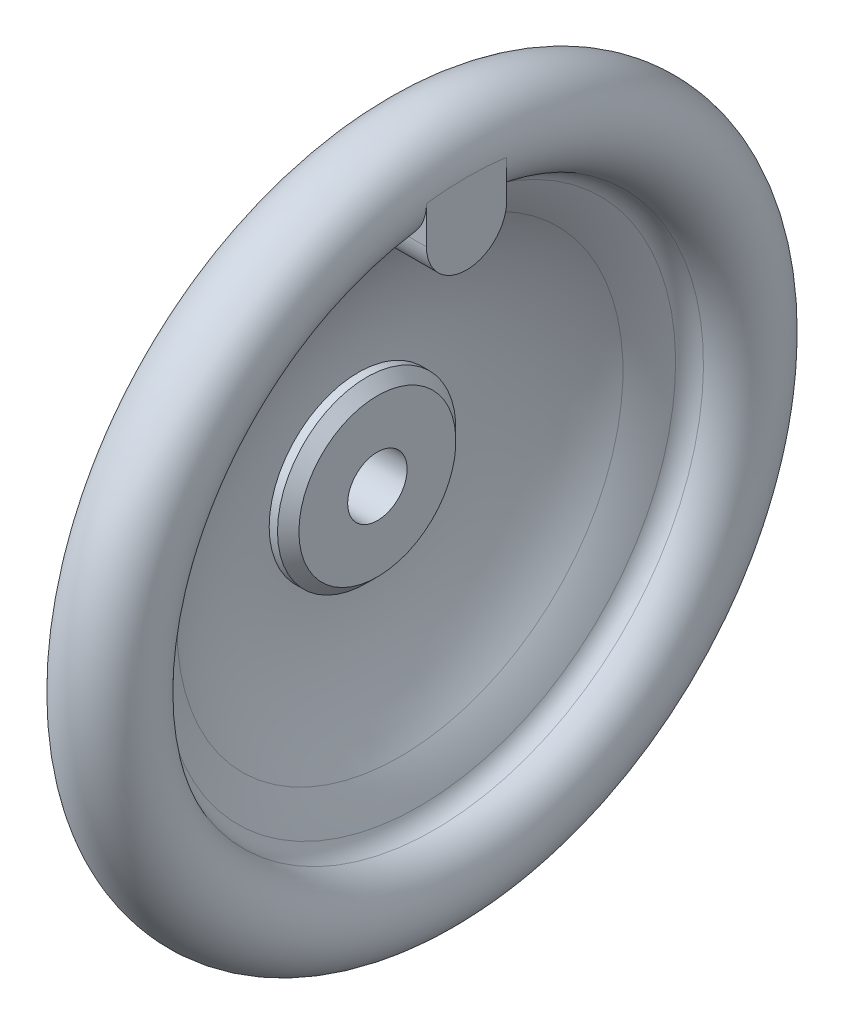
ISO-10303-21;
HEADER;
FILE_DESCRIPTION(('STEP AP214'),'2;1');
FILE_NAME('part.step','',(''),(''),'','','');
FILE_SCHEMA(('AUTOMOTIVE_DESIGN { 1 0 10303 214 1 1 1 1 }'));
ENDSEC;
DATA;
#1=APPLICATION_CONTEXT('core data for automotive mechanical design processes');
#2=APPLICATION_PROTOCOL_DEFINITION('international standard','automotive_design',2000,#1);
#3=PRODUCT_CONTEXT('',#1,'mechanical');
#4=PRODUCT('Part','Part','',(#3));
#5=PRODUCT_RELATED_PRODUCT_CATEGORY('part','',(#4));
#6=PRODUCT_DEFINITION_FORMATION('','',#4);
#7=PRODUCT_DEFINITION_CONTEXT('part definition',#1,'design');
#8=PRODUCT_DEFINITION('design','',#6,#7);
#9=PRODUCT_DEFINITION_SHAPE('','',#8);
#10=(LENGTH_UNIT() NAMED_UNIT(*) SI_UNIT(.MILLI.,.METRE.));
#11=(NAMED_UNIT(*) PLANE_ANGLE_UNIT() SI_UNIT($,.RADIAN.));
#12=(NAMED_UNIT(*) SI_UNIT($,.STERADIAN.) SOLID_ANGLE_UNIT());
#13=UNCERTAINTY_MEASURE_WITH_UNIT(LENGTH_MEASURE(1.E-05),#10,'distance_accuracy_value','');
#14=(GEOMETRIC_REPRESENTATION_CONTEXT(3) GLOBAL_UNCERTAINTY_ASSIGNED_CONTEXT((#13)) GLOBAL_UNIT_ASSIGNED_CONTEXT((#10,
#11,#12)) REPRESENTATION_CONTEXT('',''));
#15=CARTESIAN_POINT('',(0.,0.,0.));
#16=DIRECTION('',(0.,0.,1.));
#17=DIRECTION('',(1.,0.,0.));
#18=AXIS2_PLACEMENT_3D('',#15,#16,#17);
#19=CARTESIAN_POINT('',(14.7038322596735,0.,0.));
#20=DIRECTION('',(-1.,0.,0.));
#21=DIRECTION('',(0.,0.,1.));
#22=AXIS2_PLACEMENT_3D('',#19,#20,#21);
#23=TOROIDAL_SURFACE('',#22,26.3096344180005,2.54545719497326);
#24=CARTESIAN_POINT('',(12.3983950732132,27.1200426424307,3.82653592751591));
#25=CARTESIAN_POINT('',(12.4253228686659,27.1743150211529,3.85393764104516));
#26=CARTESIAN_POINT('',(12.4546459579551,27.2282266565031,3.87968646354279));
#27=CARTESIAN_POINT('',(12.5179271301108,27.3347321598006,3.92796391816657));
#28=CARTESIAN_POINT('',(12.5518838597448,27.3873264071967,3.95049348654229));
#29=CARTESIAN_POINT('',(12.6241455472938,27.4904233829854,3.99234872099097));
#30=CARTESIAN_POINT('',(12.6624322856433,27.5409337381729,4.01168702747807));
#31=CARTESIAN_POINT('',(12.7432121091829,27.6395454414313,4.04744137316007));
#32=CARTESIAN_POINT('',(12.7857052493079,27.6876467580283,4.06385737418237));
#33=CARTESIAN_POINT('',(12.919075846975,27.8275727331788,4.10903192706677));
#34=CARTESIAN_POINT('',(13.0159220358745,27.9151306706947,4.13376047607542));
#35=CARTESIAN_POINT('',(13.2228009032006,28.0754453209885,4.17452053009498));
#36=CARTESIAN_POINT('',(13.3328419999966,28.1481925037867,4.19054644638339));
#37=CARTESIAN_POINT('',(13.5359812276858,28.2613220471768,4.21313034475779));
#38=CARTESIAN_POINT('',(13.6269588466365,28.3052913254984,4.22102964522451));
#39=CARTESIAN_POINT('',(13.8134255774577,28.3823671150131,4.23390854920366));
#40=CARTESIAN_POINT('',(13.9089069818864,28.4154914652378,4.23889295820628));
#41=CARTESIAN_POINT('',(14.006071241728,28.4428744997341,4.24285497197067));
#42=B_SPLINE_CURVE_WITH_KNOTS('',3,(#24,#25,#26,#27,#28,#29,#30,#31,#32,#33,#34,#35,#36,#37,#38,
#39,#40,#41),.UNSPECIFIED.,.F.,.F.,(4,2,2,2,2,2,2,2,4),(0.,0.199409704689992,0.398761296878484,
0.597303261654983,0.795847819694866,1.19251520969519,1.58943703421541,1.89279652190561,
2.19565447089157),.UNSPECIFIED.);
#43=CARTESIAN_POINT('',(12.3985950732132,27.1204454089073,3.82673917239148));
#44=VERTEX_POINT('',#43);
#45=CARTESIAN_POINT('',(14.005871241728,28.4428180596247,4.24284687873969));
#46=VERTEX_POINT('',#45);
#47=EDGE_CURVE('E49',#44,#46,#42,.T.);
#48=ORIENTED_EDGE('',*,*,#47,.T.);
#49=CARTESIAN_POINT('',(14.005871241728,0.,0.));
#50=DIRECTION('',(-1.,0.,0.));
#51=DIRECTION('',(0.,0.,1.));
#52=AXIS2_PLACEMENT_3D('',#49,#50,#51);
#53=CIRCLE('',#52,28.7575320361352);
#54=CARTESIAN_POINT('',(14.005871241728,28.4428180596247,-4.24284687873969));
#55=VERTEX_POINT('',#54);
#56=EDGE_CURVE('E42',#55,#46,#53,.T.);
#57=ORIENTED_EDGE('',*,*,#56,.F.);
#58=CARTESIAN_POINT('',(14.4054898131147,28.5221346476046,-4.25346635185463));
#59=CARTESIAN_POINT('',(14.33803531971,28.5142325683028,-4.25247545246534));
#60=CARTESIAN_POINT('',(14.270930617878,28.5036549688224,-4.2511460954537));
#61=CARTESIAN_POINT('',(14.1376668498432,28.4772144780255,-4.24765977361147));
#62=CARTESIAN_POINT('',(14.0715097049198,28.4613420998709,-4.24550132220467));
#63=CARTESIAN_POINT('',(13.8714867603151,28.404892978376,-4.23741233691311));
#64=CARTESIAN_POINT('',(13.7399421865739,28.3559340871099,-4.22990596860255));
#65=CARTESIAN_POINT('',(13.4867068471577,28.2377124974268,-4.20876202800249));
#66=CARTESIAN_POINT('',(13.365028346963,28.1684250059359,-4.19511695795465));
#67=CARTESIAN_POINT('',(13.1348561572406,28.011871943499,-4.15909704892282));
#68=CARTESIAN_POINT('',(13.0263904250483,27.9245692695157,-4.13670410693632));
#69=CARTESIAN_POINT('',(12.8263998121289,27.735617327591,-4.08052545858083));
#70=CARTESIAN_POINT('',(12.734845311234,27.6339937042132,-4.04675997001121));
#71=CARTESIAN_POINT('',(12.6030930539128,27.4624490659216,-3.98152204792343));
#72=CARTESIAN_POINT('',(12.5567618809009,27.3955502324613,-3.95425524743924));
#73=CARTESIAN_POINT('',(12.4717737559226,27.2593177967803,-3.89441279550519));
#74=CARTESIAN_POINT('',(12.4331144593304,27.1899849460742,-3.86183877157134));
#75=CARTESIAN_POINT('',(12.3499736981073,27.0224976423818,-3.77730083307771));
#76=CARTESIAN_POINT('',(12.3092156351443,26.9237672275563,-3.72275805449137));
#77=CARTESIAN_POINT('',(12.2427992850129,26.7273399827352,-3.60341820251394));
#78=CARTESIAN_POINT('',(12.2171599782047,26.6296446025216,-3.53860836855303));
#79=CARTESIAN_POINT('',(12.1778411117333,26.428078992507,-3.39234716275278));
#80=CARTESIAN_POINT('',(12.1657288879151,26.3246615936425,-3.30985809978277));
#81=CARTESIAN_POINT('',(12.1560227191227,26.1256960130999,-3.13537599996607));
#82=CARTESIAN_POINT('',(12.1584164953419,26.0301412454219,-3.04339106585362));
#83=CARTESIAN_POINT('',(12.1691638456542,25.909593274727,-2.91613064678432));
#84=CARTESIAN_POINT('',(12.1724309336348,25.8803369261042,-2.88428906216809));
#85=CARTESIAN_POINT('',(12.185764707992,25.7801748687128,-2.77191410003454));
#86=CARTESIAN_POINT('',(12.1987239741382,25.7119391806261,-2.68929379258354));
#87=CARTESIAN_POINT('',(12.2298732335179,25.5822374697626,-2.51978380959586));
#88=CARTESIAN_POINT('',(12.2480683428892,25.520778150069,-2.43289002747684));
#89=CARTESIAN_POINT('',(12.2881503968465,25.4045259856849,-2.25492566815193));
#90=CARTESIAN_POINT('',(12.3100553428589,25.3497680038945,-2.1638363820219));
#91=CARTESIAN_POINT('',(12.3558466105236,25.2473734847913,-1.97830676640614));
#92=CARTESIAN_POINT('',(12.3797324753845,25.1997353127411,-1.88386721233641));
#93=CARTESIAN_POINT('',(12.4534996051754,25.0646904060111,-1.58959738441426));
#94=CARTESIAN_POINT('',(12.5040393282576,24.9888005422863,-1.38439037532715));
#95=CARTESIAN_POINT('',(12.569765578118,24.8988441398925,-1.06836602104014));
#96=CARTESIAN_POINT('',(12.58996928302,24.8728611626421,-0.961833875435909));
#97=CARTESIAN_POINT('',(12.6252428171458,24.8290300438266,-0.746243452802461));
#98=CARTESIAN_POINT('',(12.6403143529542,24.8111791974403,-0.637186028404991));
#99=CARTESIAN_POINT('',(12.66191104588,24.7860668803565,-0.434594660113356));
#100=CARTESIAN_POINT('',(12.6694071288677,24.7775820432221,-0.3413148461316));
#101=CARTESIAN_POINT('',(12.679023486085,24.766746596068,-0.154123557716842));
#102=CARTESIAN_POINT('',(12.6811445069615,24.7643951340632,-0.060212172832359));
#103=CARTESIAN_POINT('',(12.679824378848,24.7658695313517,0.127574044433131));
#104=CARTESIAN_POINT('',(12.6763801166988,24.7696988481045,0.221448826953227));
#105=CARTESIAN_POINT('',(12.6642241404111,24.7834714795037,0.408407032940391));
#106=CARTESIAN_POINT('',(12.6555115436192,24.7934158186616,0.501490321150451));
#107=CARTESIAN_POINT('',(12.6311661522577,24.8220352814916,0.706050614973056));
#108=CARTESIAN_POINT('',(12.6144514544696,24.8421233582242,0.817201148240089));
#109=CARTESIAN_POINT('',(12.5760618125976,24.8907521084082,1.03675177160381));
#110=CARTESIAN_POINT('',(12.5543854080021,24.9192952713995,1.14515104139015));
#111=CARTESIAN_POINT('',(12.5080046872681,24.9846344715229,1.35908577821475));
#112=CARTESIAN_POINT('',(12.4832926023218,25.0214518920871,1.46461301627168));
#113=CARTESIAN_POINT('',(12.4328960699903,25.1030833595212,1.67223806839914));
#114=CARTESIAN_POINT('',(12.4072115145397,25.1478982971795,1.77433549894017));
#115=CARTESIAN_POINT('',(12.3303425186022,25.296705988193,2.08027517746222));
#116=CARTESIAN_POINT('',(12.2806419088898,25.4134988008879,2.27861886973054));
#117=CARTESIAN_POINT('',(12.2215729215639,25.6129448787638,2.56189493454342));
#118=CARTESIAN_POINT('',(12.2044674140714,25.6834359446671,2.65391232978031));
#119=CARTESIAN_POINT('',(12.1774732746377,25.8323792894927,2.83273876566149));
#120=CARTESIAN_POINT('',(12.1676018875774,25.9108500873717,2.91953491099543));
#121=CARTESIAN_POINT('',(12.1624307317469,25.9930775329131,3.00325160851566));
#122=B_SPLINE_CURVE_WITH_KNOTS('',3,(#58,#59,#60,#61,#62,#63,#64,#65,#66,#67,#68,#69,#70,#71,
#72,#73,#74,#75,#76,#77,#78,#79,#80,#81,#82,#83,#84,#85,#86,#87,#88,#89,#90,#91,#92,#93,#94,#95,
#96,#97,#98,#99,#100,#101,#102,#103,#104,#105,#106,#107,#108,#109,#110,#111,#112,#113,#114,#115,
#116,#117,#118,#119,#120,#121),.UNSPECIFIED.,.F.,.F.,(4,2,2,2,2,2,2,2,2,2,2,2,2,2,2,2,2,2,2,2,2,
2,2,2,2,2,2,2,2,2,2,4),(0.,0.203652536609416,0.407671942135864,0.82726990565277,
1.24738175982708,1.66836764608905,2.08860903130355,2.34558341306481,2.6024791387368,
2.96075863866527,3.31948697679497,3.71647784224213,4.11313271618453,4.24321343270538,
4.56647116973613,4.89004585282983,5.21523814457215,5.54035565575424,6.21086787587777,
6.54504848261865,6.87911785653389,7.16068200551973,7.44220704044354,7.72388961195875,
8.00561938947092,8.3476378365284,8.68975708875342,9.03277087098702,9.37582288304289,
10.0783723399967,10.4293601915309,10.7811820391307),.UNSPECIFIED.);
#123=CARTESIAN_POINT('',(12.3985950732132,27.1204454089073,-3.82673917239148));
#124=VERTEX_POINT('',#123);
#125=EDGE_CURVE('E55',#55,#124,#122,.T.);
#126=ORIENTED_EDGE('',*,*,#125,.T.);
#127=CARTESIAN_POINT('',(12.3985950732132,0.,0.));
#128=DIRECTION('',(-1.,0.,0.));
#129=DIRECTION('',(0.,0.,1.));
#130=AXIS2_PLACEMENT_3D('',#127,#128,#129);
#131=CIRCLE('',#130,27.3890943966944);
#132=EDGE_CURVE('E113',#124,#44,#131,.T.);
#133=ORIENTED_EDGE('',*,*,#132,.T.);
#134=EDGE_LOOP('',(#48,#57,#126,#133));
#135=FACE_BOUND('',#134,.T.);
#136=ADVANCED_FACE('F34',(#135),#23,.F.);
#137=CARTESIAN_POINT('',(12.7,0.,0.));
#138=DIRECTION('',(-1.,0.,0.));
#139=DIRECTION('',(0.,0.,1.));
#140=AXIS2_PLACEMENT_3D('',#137,#138,#139);
#141=TOROIDAL_SURFACE('',#140,33.3375,4.7625);
#142=CARTESIAN_POINT('',(7.9375,0.,0.));
#143=DIRECTION('',(-1.,0.,0.));
#144=DIRECTION('',(0.,0.,1.));
#145=AXIS2_PLACEMENT_3D('',#142,#143,#144);
#146=CIRCLE('',#145,33.3375);
#147=CARTESIAN_POINT('',(7.9375,0.,33.3375));
#148=VERTEX_POINT('',#147);
#149=EDGE_CURVE('E244',#148,#148,#146,.T.);
#150=ORIENTED_EDGE('',*,*,#149,.F.);
#151=EDGE_LOOP('',(#150));
#152=FACE_BOUND('',#151,.T.);
#153=CARTESIAN_POINT('',(9.04224704107469,29.9827150928867,-4.28625));
#154=CARTESIAN_POINT('',(9.21275132392795,29.7761713757377,-4.28625));
#155=CARTESIAN_POINT('',(9.40067583369208,29.58377016399,-4.28625));
#156=CARTESIAN_POINT('',(9.80623789622986,29.2329926536837,-4.28625));
#157=CARTESIAN_POINT('',(10.0239077048461,29.0746537788979,-4.28625));
#158=CARTESIAN_POINT('',(10.4828236702853,28.796872176748,-4.28625));
#159=CARTESIAN_POINT('',(10.7240690526947,28.677428172318,-4.28625));
#160=CARTESIAN_POINT('',(11.2232366953579,28.4811138058209,-4.28625));
#161=CARTESIAN_POINT('',(11.4811546115444,28.4042324035018,-4.28625));
#162=CARTESIAN_POINT('',(12.0044257223053,28.2957605415577,-4.28625));
#163=CARTESIAN_POINT('',(12.269712762285,28.2638509493621,-4.28625));
#164=CARTESIAN_POINT('',(12.8018700501705,28.2452820768702,-4.28625));
#165=CARTESIAN_POINT('',(13.0687402974918,28.2586227798699,-4.28625));
#166=CARTESIAN_POINT('',(13.5950128463796,28.3299520501882,-4.28625));
#167=CARTESIAN_POINT('',(13.8544469174513,28.3877066310113,-4.28625));
#168=CARTESIAN_POINT('',(14.3599807786693,28.5458238866738,-4.28625));
#169=CARTESIAN_POINT('',(14.6060804968231,28.6461867915307,-4.28625));
#170=CARTESIAN_POINT('',(15.0788178071825,28.8868845048028,-4.28625));
#171=CARTESIAN_POINT('',(15.3053942136568,29.0273394241387,-4.28625));
#172=CARTESIAN_POINT('',(15.7320332693857,29.3439663183583,-4.28625));
#173=CARTESIAN_POINT('',(15.9320947597692,29.5201398535227,-4.28625));
#174=CARTESIAN_POINT('',(16.3020144604848,29.9049201816417,-4.28625));
#175=CARTESIAN_POINT('',(16.4715770438482,30.1138111585607,-4.28625));
#176=CARTESIAN_POINT('',(16.7736356533954,30.5568627516618,-4.28625));
#177=CARTESIAN_POINT('',(16.9061296339622,30.7910247614286,-4.28625));
#178=CARTESIAN_POINT('',(17.1316117477534,31.2804544199382,-4.28625));
#179=CARTESIAN_POINT('',(17.2241990230268,31.5359067977057,-4.28625));
#180=CARTESIAN_POINT('',(17.3654397209603,32.0586837605972,-4.28625));
#181=CARTESIAN_POINT('',(17.4140915773274,32.3260087686228,-4.28625));
#182=CARTESIAN_POINT('',(17.4662505784062,32.8665150294043,-4.28625));
#183=CARTESIAN_POINT('',(17.4695086734011,33.1397203590346,-4.28625));
#184=CARTESIAN_POINT('',(17.4300908259122,33.6828015570522,-4.28625));
#185=CARTESIAN_POINT('',(17.3874146577594,33.9526774090757,-4.28625));
#186=CARTESIAN_POINT('',(17.2572721166765,34.4812600733417,-4.28625));
#187=CARTESIAN_POINT('',(17.1698294262947,34.7399727128006,-4.28625));
#188=CARTESIAN_POINT('',(16.9525296355564,35.2389311192885,-4.28625));
#189=CARTESIAN_POINT('',(16.8226735013285,35.4791773068078,-4.28625));
#190=CARTESIAN_POINT('',(16.524913242991,35.9330349351221,-4.28625));
#191=CARTESIAN_POINT('',(16.3572085866678,36.1467772198772,-4.28625));
#192=CARTESIAN_POINT('',(15.9880642074146,36.5428222812659,-4.28625));
#193=CARTESIAN_POINT('',(15.7866257205761,36.7251262093824,-4.28625));
#194=CARTESIAN_POINT('',(15.3572435126325,37.0517657217427,-4.28625));
#195=CARTESIAN_POINT('',(15.1294949030389,37.1963577944461,-4.28625));
#196=CARTESIAN_POINT('',(14.6528389360363,37.4449780150859,-4.28625));
#197=CARTESIAN_POINT('',(14.403932337404,37.5490076169436,-4.28625));
#198=CARTESIAN_POINT('',(13.8936733869418,37.7129132548112,-4.28625));
#199=CARTESIAN_POINT('',(13.6324068594164,37.7730565373899,-4.28625));
#200=CARTESIAN_POINT('',(13.1034766043699,37.8484584220282,-4.28625));
#201=CARTESIAN_POINT('',(12.8358130257475,37.8637180677817,-4.28625));
#202=CARTESIAN_POINT('',(12.3026636527852,37.8489295180955,-4.28625));
#203=CARTESIAN_POINT('',(12.0371735379837,37.8190365089342,-4.28625));
#204=CARTESIAN_POINT('',(11.5149827113952,37.7151068165417,-4.28625));
#205=CARTESIAN_POINT('',(11.2582819414491,37.6410704254676,-4.28625));
#206=CARTESIAN_POINT('',(10.7608860734983,37.4510035571782,-4.28625));
#207=CARTESIAN_POINT('',(10.5201935882147,37.3349662447819,-4.28625));
#208=CARTESIAN_POINT('',(10.0616098483203,37.0642716355589,-4.28625));
#209=CARTESIAN_POINT('',(9.84371894168682,36.9096137494617,-4.28625));
#210=CARTESIAN_POINT('',(9.43603167474057,36.5654954203617,-4.28625));
#211=CARTESIAN_POINT('',(9.24634200084438,36.3759086042869,-4.28625));
#212=CARTESIAN_POINT('',(8.90124546169246,35.9677531465539,-4.28625));
#213=CARTESIAN_POINT('',(8.74583968683966,35.7491835834504,-4.28625));
#214=CARTESIAN_POINT('',(8.47266780347425,35.2878132741036,-4.28625));
#215=CARTESIAN_POINT('',(8.35514375946947,35.0448692157276,-4.28625));
#216=CARTESIAN_POINT('',(8.16223690377213,34.5428021635393,-4.28625));
#217=CARTESIAN_POINT('',(8.08685406310046,34.2836791808527,-4.28625));
#218=CARTESIAN_POINT('',(7.97983715449784,33.7547098712399,-4.28625));
#219=CARTESIAN_POINT('',(7.94850510866625,33.4848024395817,-4.28625));
#220=CARTESIAN_POINT('',(7.93135137616878,32.9434711023621,-4.28625));
#221=CARTESIAN_POINT('',(7.94554234359677,32.6720467960868,-4.28625));
#222=CARTESIAN_POINT('',(8.01920925070829,32.1339311605729,-4.28625));
#223=CARTESIAN_POINT('',(8.07893085202944,31.8672735654086,-4.28625));
#224=CARTESIAN_POINT('',(8.24226462556053,31.3479901757311,-4.28625));
#225=CARTESIAN_POINT('',(8.3458254858372,31.0953483661269,-4.28625));
#226=CARTESIAN_POINT('',(8.54912611884374,30.6984454746457,-4.28625));
#227=CARTESIAN_POINT('',(8.63683287008116,30.5478963339487,-4.28625));
#228=CARTESIAN_POINT('',(8.82798963272541,30.2571454794826,-4.28625));
#229=CARTESIAN_POINT('',(8.93143966940873,30.1169437823273,-4.28625));
#230=CARTESIAN_POINT('',(9.04224704107469,29.9827150928867,-4.28625));
#231=B_SPLINE_CURVE_WITH_KNOTS('',3,(#153,#154,#155,#156,#157,#158,#159,#160,#161,#162,#163,
#164,#165,#166,#167,#168,#169,#170,#171,#172,#173,#174,#175,#176,#177,#178,#179,#180,#181,#182,
#183,#184,#185,#186,#187,#188,#189,#190,#191,#192,#193,#194,#195,#196,#197,#198,#199,#200,#201,
#202,#203,#204,#205,#206,#207,#208,#209,#210,#211,#212,#213,#214,#215,#216,#217,#218,#219,#220,
#221,#222,#223,#224,#225,#226,#227,#228,#229,#230),.UNSPECIFIED.,.T.,.F.,(4,2,2,2,2,2,2,2,2,2,2,
2,2,2,2,2,2,2,2,2,2,2,2,2,2,2,2,2,2,2,2,2,2,2,2,2,2,2,4),(0.,0.802858195032202,1.6065940234049,
2.41030345942475,3.21380432462025,4.01157410943778,4.80934359976269,5.60293873826105,
6.3965381609721,7.19254052617561,7.98857767029518,8.79195770168062,9.59538205855242,
10.4066985958294,11.2180440553081,12.0338391632978,12.8496382792005,13.6650062633757,
14.4803556757167,15.291504454303,16.1026235168809,16.9080729230697,17.7134934560731,
18.5139674756732,19.3144228814401,20.1121334350508,20.9098387091765,21.7076738593391,
22.5055211835709,23.3063139267122,24.1071321354777,24.9129705509368,25.7188084122466,
26.5301447734459,27.3417066824569,28.1576786572621,28.9726982018382,29.4944590754587,
30.0162207867969),.UNSPECIFIED.);
#232=CARTESIAN_POINT('',(15.3280373154416,29.05125,-4.28625));
#233=VERTEX_POINT('',#232);
#234=CARTESIAN_POINT('',(17.4625,33.0608071163954,-4.28625));
#235=VERTEX_POINT('',#234);
#236=EDGE_CURVE('E135',#233,#235,#231,.T.);
#237=ORIENTED_EDGE('',*,*,#236,.F.);
#238=CARTESIAN_POINT('',(10.0716636870647,29.0514500000003,-4.28624999533392));
#239=CARTESIAN_POINT('',(10.1810927078329,28.9782224062931,-4.28622704046397));
#240=CARTESIAN_POINT('',(10.2936735276267,28.9097798879974,-4.28437927109515));
#241=CARTESIAN_POINT('',(10.5241794396828,28.7828246196172,-4.2783155098347));
#242=CARTESIAN_POINT('',(10.6421020511777,28.724307318894,-4.2741006070986));
#243=CARTESIAN_POINT('',(10.8822749735768,28.6175650689382,-4.26458792959267));
#244=CARTESIAN_POINT('',(11.0045193311975,28.5693265587429,-4.25929159986989));
#245=CARTESIAN_POINT('',(11.2526204062434,28.4832324676764,-4.24866821494648));
#246=CARTESIAN_POINT('',(11.3784774684618,28.4453778815016,-4.2433411568522));
#247=CARTESIAN_POINT('',(11.6327896001638,28.3802329684022,-4.23352797918335));
#248=CARTESIAN_POINT('',(11.7612418809479,28.3529318767032,-4.22904100512893));
#249=CARTESIAN_POINT('',(12.0199922804874,28.3089334702656,-4.22154051632626));
#250=CARTESIAN_POINT('',(12.1502904009158,28.2922361651387,-4.21852700291361));
#251=CARTESIAN_POINT('',(12.4118757272062,28.2695002941604,-4.21437308910102));
#252=CARTESIAN_POINT('',(12.5431631692319,28.2634643598309,-4.21323315115628));
#253=CARTESIAN_POINT('',(12.8057947178035,28.2620799964266,-4.21297401154382));
#254=CARTESIAN_POINT('',(12.937138823914,28.2667314866141,-4.21385479461065));
#255=CARTESIAN_POINT('',(13.2016003523982,28.286905485326,-4.21756143501929));
#256=CARTESIAN_POINT('',(13.3347008825454,28.3026430027294,-4.22042574306619));
#257=CARTESIAN_POINT('',(13.5990965405034,28.3451657587065,-4.22774741153605));
#258=CARTESIAN_POINT('',(13.730391450415,28.3719523187775,-4.23220496250693));
#259=CARTESIAN_POINT('',(13.9901088126812,28.4364475372597,-4.24205377016508));
#260=CARTESIAN_POINT('',(14.1185337863702,28.4741461671895,-4.24744416772068));
#261=CARTESIAN_POINT('',(14.3716640449749,28.560312596461,-4.25826239751889));
#262=CARTESIAN_POINT('',(14.4963707424408,28.608776245558,-4.26369021455583));
#263=CARTESIAN_POINT('',(14.7424541868251,28.7168364985819,-4.27353433814297));
#264=CARTESIAN_POINT('',(14.8637834960276,28.7765424741878,-4.27793966761399));
#265=CARTESIAN_POINT('',(15.1006201920487,28.906313884611,-4.28428292057461));
#266=CARTESIAN_POINT('',(15.2161350766087,28.9763654946279,-4.28622410417103));
#267=CARTESIAN_POINT('',(15.3283363129349,29.0514500000001,-4.28624999533392));
#268=B_SPLINE_CURVE_WITH_KNOTS('',3,(#238,#239,#240,#241,#242,#243,#244,#245,#246,#247,#248,
#249,#250,#251,#252,#253,#254,#255,#256,#257,#258,#259,#260,#261,#262,#263,#264,#265,#266,#267),
.UNSPECIFIED.,.F.,.F.,(4,2,2,2,2,2,2,2,2,2,2,2,2,2,4),(0.,0.394816030165205,0.789450547880693,
1.18356114979164,1.57770949115007,1.97145472575237,2.36520031726059,2.75904308252402,
3.15288287252703,3.55457915332436,3.95632349209228,4.35769978310138,4.75892159900641,
5.16426981435002,5.56908118627585),.UNSPECIFIED.);
#269=EDGE_CURVE('E152',#55,#233,#268,.T.);
#270=ORIENTED_EDGE('',*,*,#269,.F.);
#271=ORIENTED_EDGE('',*,*,#56,.T.);
#272=CARTESIAN_POINT('',(15.3283363129349,29.0514500000001,4.28624999533392));
#273=CARTESIAN_POINT('',(15.2189072921667,28.9782224062929,4.28622704046396));
#274=CARTESIAN_POINT('',(15.1063264723729,28.9097798879972,4.28437927109514));
#275=CARTESIAN_POINT('',(14.8758205603168,28.782824619617,4.27831550983468));
#276=CARTESIAN_POINT('',(14.7578979488219,28.7243073188938,4.27410060709858));
#277=CARTESIAN_POINT('',(14.5177250264228,28.617565068938,4.26458792959265));
#278=CARTESIAN_POINT('',(14.3954806688021,28.5693265587427,4.25929159986987));
#279=CARTESIAN_POINT('',(14.1473795937562,28.4832324676763,4.24866821494646));
#280=CARTESIAN_POINT('',(14.0215225315378,28.4453778815014,4.24334115685218));
#281=CARTESIAN_POINT('',(13.7672103998358,28.3802329684021,4.23352797918333));
#282=CARTESIAN_POINT('',(13.6387581190516,28.3529318767031,4.22904100512892));
#283=CARTESIAN_POINT('',(13.3800077195121,28.3089334702655,4.22154051632625));
#284=CARTESIAN_POINT('',(13.2497095990838,28.2922361651387,4.2185270029136));
#285=CARTESIAN_POINT('',(12.9881242727933,28.2695002941604,4.21437308910102));
#286=CARTESIAN_POINT('',(12.8568368307677,28.2634643598309,4.21323315115628));
#287=CARTESIAN_POINT('',(12.594205282196,28.2620799964267,4.21297401154382));
#288=CARTESIAN_POINT('',(12.4628611760856,28.2667314866141,4.21385479461065));
#289=CARTESIAN_POINT('',(12.1983996476013,28.286905485326,4.2175614350193));
#290=CARTESIAN_POINT('',(12.0652991174541,28.3026430027295,4.22042574306621));
#291=CARTESIAN_POINT('',(11.8009034594962,28.3451657587066,4.22774741153607));
#292=CARTESIAN_POINT('',(11.6696085495845,28.3719523187776,4.23220496250695));
#293=CARTESIAN_POINT('',(11.4098911873184,28.4364475372599,4.2420537701651));
#294=CARTESIAN_POINT('',(11.2814662136293,28.4741461671896,4.2474441677207));
#295=CARTESIAN_POINT('',(11.0283359550247,28.5603125964611,4.25826239751891));
#296=CARTESIAN_POINT('',(10.9036292575587,28.6087762455582,4.26369021455585));
#297=CARTESIAN_POINT('',(10.6575458131745,28.7168364985821,4.27353433814298));
#298=CARTESIAN_POINT('',(10.536216503972,28.776542474188,4.27793966761401));
#299=CARTESIAN_POINT('',(10.2993798079509,28.9063138846112,4.28428292057461));
#300=CARTESIAN_POINT('',(10.1838649233909,28.9763654946281,4.28622410417104));
#301=CARTESIAN_POINT('',(10.0716636870647,29.0514500000003,4.28624999533392));
#302=B_SPLINE_CURVE_WITH_KNOTS('',3,(#272,#273,#274,#275,#276,#277,#278,#279,#280,#281,#282,
#283,#284,#285,#286,#287,#288,#289,#290,#291,#292,#293,#294,#295,#296,#297,#298,#299,#300,#301),
.UNSPECIFIED.,.F.,.F.,(4,2,2,2,2,2,2,2,2,2,2,2,2,2,4),(0.,0.394816030165211,0.789450547880702,
1.18356114979166,1.57770949115009,1.9714547257524,2.36520031726062,2.75904308252405,
3.15288287252708,3.5545791533244,3.95632349209232,4.35769978310142,4.75892159900645,
5.16426981435004,5.56908118627585),.UNSPECIFIED.);
#303=CARTESIAN_POINT('',(15.3280373154416,29.05125,4.28625));
#304=VERTEX_POINT('',#303);
#305=EDGE_CURVE('E130',#304,#46,#302,.T.);
#306=ORIENTED_EDGE('',*,*,#305,.F.);
#307=CARTESIAN_POINT('',(9.04224704107469,29.9827150928867,4.28625));
#308=CARTESIAN_POINT('',(8.9558490711704,30.0873826592879,4.28625));
#309=CARTESIAN_POINT('',(8.87389645783799,30.1957022186101,4.28625));
#310=CARTESIAN_POINT('',(8.71940212539566,30.4189099768965,4.28625));
#311=CARTESIAN_POINT('',(8.64686310628591,30.533800046857,4.28625));
#312=CARTESIAN_POINT('',(8.51166161238419,30.769399303439,4.28625));
#313=CARTESIAN_POINT('',(8.44900892463323,30.890114103871,4.28625));
#314=CARTESIAN_POINT('',(8.33407324914794,31.1364375799823,4.28625));
#315=CARTESIAN_POINT('',(8.28179408883457,31.2620480415916,4.28625));
#316=CARTESIAN_POINT('',(8.18804387535661,31.5170860511648,4.28625));
#317=CARTESIAN_POINT('',(8.14656129677941,31.6465093631682,4.28625));
#318=CARTESIAN_POINT('',(8.07460242390041,31.9084315856943,4.28625));
#319=CARTESIAN_POINT('',(8.04413018720619,32.0409316109631,4.28625));
#320=CARTESIAN_POINT('',(7.9944405549507,32.3079380156378,4.28625));
#321=CARTESIAN_POINT('',(7.97521600443396,32.4424430636222,4.28625));
#322=CARTESIAN_POINT('',(7.94812242059226,32.7126422479093,4.28625));
#323=CARTESIAN_POINT('',(7.94025758345861,32.848336804996,4.28625));
#324=CARTESIAN_POINT('',(7.93595122171747,33.1202599931967,4.28625));
#325=CARTESIAN_POINT('',(7.93953941178682,33.2564890961915,4.28625));
#326=CARTESIAN_POINT('',(7.95819033280882,33.5282105206795,4.28625));
#327=CARTESIAN_POINT('',(7.97325731537465,33.6637025504374,4.28625));
#328=CARTESIAN_POINT('',(8.01476834268436,33.9328880022645,4.28625));
#329=CARTESIAN_POINT('',(8.04120871233288,34.0665819909577,4.28625));
#330=CARTESIAN_POINT('',(8.10530302162061,34.3313070008799,4.28625));
#331=CARTESIAN_POINT('',(8.14296108609673,34.4623370235818,4.28625));
#332=CARTESIAN_POINT('',(8.22913816520104,34.7204519990051,4.28625));
#333=CARTESIAN_POINT('',(8.27763280859164,34.847545086677,4.28625));
#334=CARTESIAN_POINT('',(8.38521818444611,35.0972181624558,4.28625));
#335=CARTESIAN_POINT('',(8.44431283279116,35.2197964624585,4.28625));
#336=CARTESIAN_POINT('',(8.57266411009551,35.4594619616841,4.28625));
#337=CARTESIAN_POINT('',(8.64191674273894,35.5765512965586,4.28625));
#338=CARTESIAN_POINT('',(8.79011049264101,35.8044456440108,4.28625));
#339=CARTESIAN_POINT('',(8.86905515956976,35.9152483322745,4.28625));
#340=CARTESIAN_POINT('',(9.11860704437312,36.2356293176581,4.28625));
#341=CARTESIAN_POINT('',(9.30283580174593,36.4348633866394,4.28625));
#342=CARTESIAN_POINT('',(9.7022410226766,36.7991895260923,4.28625));
#343=CARTESIAN_POINT('',(9.91741625979078,36.9642829489641,4.28625));
#344=CARTESIAN_POINT('',(10.3710845783338,37.2545835678572,4.28625));
#345=CARTESIAN_POINT('',(10.6094037145751,37.3800621300159,4.28625));
#346=CARTESIAN_POINT('',(11.1038043119586,37.5889590887751,4.28625));
#347=CARTESIAN_POINT('',(11.3598851953551,37.6723788527157,4.28625));
#348=CARTESIAN_POINT('',(11.8809959678348,37.7943528077484,4.28625));
#349=CARTESIAN_POINT('',(12.1459673907803,37.8331568226259,4.28625));
#350=CARTESIAN_POINT('',(12.6786584122759,37.8655993239034,4.28625));
#351=CARTESIAN_POINT('',(12.94637795539,37.8592387195986,4.28625));
#352=CARTESIAN_POINT('',(13.4762274766834,37.801618115885,4.28625));
#353=CARTESIAN_POINT('',(13.7383702439114,37.7504756047413,4.28625));
#354=CARTESIAN_POINT('',(14.2503615184954,37.6049499370514,4.28625));
#355=CARTESIAN_POINT('',(14.5002100360332,37.5105668163168,4.28625));
#356=CARTESIAN_POINT('',(14.980828758958,37.2811901461972,4.28625));
#357=CARTESIAN_POINT('',(15.2115787468435,37.1461542458505,4.28625));
#358=CARTESIAN_POINT('',(15.6472621553304,36.8394203070619,4.28625));
#359=CARTESIAN_POINT('',(15.8521951161922,36.66772161589,4.28625));
#360=CARTESIAN_POINT('',(16.2314273460755,36.2917542543728,4.28625));
#361=CARTESIAN_POINT('',(16.4055870028271,36.0873447803274,4.28625));
#362=CARTESIAN_POINT('',(16.7173840994177,35.6523516251908,4.28625));
#363=CARTESIAN_POINT('',(16.8550203500407,35.4217670921786,4.28625));
#364=CARTESIAN_POINT('',(17.0908428061117,34.9393439890011,4.28625));
#365=CARTESIAN_POINT('',(17.188761995554,34.6873748995716,4.28625));
#366=CARTESIAN_POINT('',(17.341225624259,34.1706400451444,4.28625));
#367=CARTESIAN_POINT('',(17.3957684001602,33.9058737898249,4.28625));
#368=CARTESIAN_POINT('',(17.4602813480743,33.3691580864403,4.28625));
#369=CARTESIAN_POINT('',(17.4699496164329,33.0971723307267,4.28625));
#370=CARTESIAN_POINT('',(17.4436876771456,32.5554082077198,4.28625));
#371=CARTESIAN_POINT('',(17.4077560512131,32.2856299093473,4.28625));
#372=CARTESIAN_POINT('',(17.29106865626,31.7547893976189,4.28625));
#373=CARTESIAN_POINT('',(17.2101311152537,31.4937671111444,4.28625));
#374=CARTESIAN_POINT('',(17.0055400166901,30.9890327706753,4.28625));
#375=CARTESIAN_POINT('',(16.8818862764652,30.7453207907103,4.28625));
#376=CARTESIAN_POINT('',(16.595417732528,30.2824884402694,4.28625));
#377=CARTESIAN_POINT('',(16.4326488403744,30.0633396775999,4.28625));
#378=CARTESIAN_POINT('',(16.0724247671196,29.6557381920597,4.28625));
#379=CARTESIAN_POINT('',(15.8749706681902,29.4672845118616,4.28625));
#380=CARTESIAN_POINT('',(15.4522658597717,29.1278501204953,4.28625));
#381=CARTESIAN_POINT('',(15.2272241015879,28.9766109855359,4.28625));
#382=CARTESIAN_POINT('',(14.8731214316686,28.7801241290344,4.28625));
#383=CARTESIAN_POINT('',(14.7522630055686,28.7196668286483,4.28625));
#384=CARTESIAN_POINT('',(14.5058410110628,28.6092917017588,4.28625));
#385=CARTESIAN_POINT('',(14.3802792727909,28.5593698249011,4.28625));
#386=CARTESIAN_POINT('',(14.1266243624122,28.4708994568724,4.28625));
#387=CARTESIAN_POINT('',(13.9985688765065,28.4322426036524,4.28625));
#388=CARTESIAN_POINT('',(13.7396864879828,28.3659442644572,4.28625));
#389=CARTESIAN_POINT('',(13.6088606673885,28.3382985584265,4.28625));
#390=CARTESIAN_POINT('',(13.3452958280062,28.2942116851633,4.28625));
#391=CARTESIAN_POINT('',(13.2125562640652,28.2777737776825,4.28625));
#392=CARTESIAN_POINT('',(12.9462097852594,28.2562470692322,4.28625));
#393=CARTESIAN_POINT('',(12.812603215753,28.2511539978344,4.28625));
#394=CARTESIAN_POINT('',(12.5464440346909,28.2523397045605,4.28625));
#395=CARTESIAN_POINT('',(12.4138910363603,28.2585334501121,4.28625));
#396=CARTESIAN_POINT('',(12.1498291261514,28.28207495199,4.28625));
#397=CARTESIAN_POINT('',(12.0183198428667,28.2994185422356,4.28625));
#398=CARTESIAN_POINT('',(11.757151128486,28.3451367585296,4.28625));
#399=CARTESIAN_POINT('',(11.6274928656535,28.3735180573069,4.28625));
#400=CARTESIAN_POINT('',(11.3710727927582,28.4410821118765,4.28625));
#401=CARTESIAN_POINT('',(11.244309949162,28.4802609460667,4.28625));
#402=CARTESIAN_POINT('',(10.9944464105319,28.5691553202154,4.28625));
#403=CARTESIAN_POINT('',(10.8713480264303,28.6188773550018,4.28625));
#404=CARTESIAN_POINT('',(10.6297993296693,28.7284498112266,4.28625));
#405=CARTESIAN_POINT('',(10.511347368068,28.7882965987496,4.28625));
#406=CARTESIAN_POINT('',(10.279963169633,28.9176319246958,4.28625));
#407=CARTESIAN_POINT('',(10.1670262396673,28.9871120650256,4.28625));
#408=CARTESIAN_POINT('',(9.94737236114205,29.1352166476003,4.28625));
#409=CARTESIAN_POINT('',(9.84065369888953,29.2138385524021,4.28625));
#410=CARTESIAN_POINT('',(9.61025347259705,29.3988462912966,4.28625));
#411=CARTESIAN_POINT('',(9.48834466717214,29.5074511556483,4.28625));
#412=CARTESIAN_POINT('',(9.2562346699453,29.7365190741594,4.28625));
#413=CARTESIAN_POINT('',(9.14603347343565,29.8569821235506,4.28625));
#414=CARTESIAN_POINT('',(9.04224704107469,29.9827150928867,4.28625));
#415=B_SPLINE_CURVE_WITH_KNOTS('',3,(#307,#308,#309,#310,#311,#312,#313,#314,#315,#316,#317,
#318,#319,#320,#321,#322,#323,#324,#325,#326,#327,#328,#329,#330,#331,#332,#333,#334,#335,#336,
#337,#338,#339,#340,#341,#342,#343,#344,#345,#346,#347,#348,#349,#350,#351,#352,#353,#354,#355,
#356,#357,#358,#359,#360,#361,#362,#363,#364,#365,#366,#367,#368,#369,#370,#371,#372,#373,#374,
#375,#376,#377,#378,#379,#380,#381,#382,#383,#384,#385,#386,#387,#388,#389,#390,#391,#392,#393,
#394,#395,#396,#397,#398,#399,#400,#401,#402,#403,#404,#405,#406,#407,#408,#409,#410,#411,#412,
#413,#414),.UNSPECIFIED.,.T.,.F.,(4,2,2,2,2,2,2,2,2,2,2,2,2,2,2,2,2,2,2,2,2,2,2,2,2,2,2,2,2,2,2,
2,2,2,2,2,2,2,2,2,2,2,2,2,2,2,2,2,2,2,2,2,2,4),(0.,0.407015700902391,0.814147884941954,
1.22168061736512,1.62936343477924,2.03660924670121,2.44400498696987,2.85114128929269,
3.2584279462253,3.66677215929292,4.07526769195228,4.4836313260304,4.89214530445889,
5.29974962836722,5.70750484180297,6.11510006585705,6.52284501792985,7.33267773498235,
8.14247836629622,8.94660495928149,9.75070540826333,10.5502810643418,11.3498406226825,
12.1473087481978,12.9447762132579,13.7430773501609,14.5413927008906,15.3432417157074,
16.1451168358313,16.9522969668271,17.7595080493785,18.5721420348281,19.384801296126,
20.2007668566039,21.0167359064456,21.8317518476615,22.6467423650532,23.4559027408008,
23.8609067061077,24.2657546824298,24.6665689897984,25.0672295357184,25.468006562805,
25.8686327037103,26.2662530779156,26.6637249696398,27.0614375232096,27.4590058198196,
27.8568197418803,28.2544911846975,28.651818103071,29.0490349990829,29.5379669096889,
30.0268986236904),.UNSPECIFIED.);
#416=CARTESIAN_POINT('',(17.4625,33.0608071163954,4.28625));
#417=VERTEX_POINT('',#416);
#418=EDGE_CURVE('E85',#417,#304,#415,.T.);
#419=ORIENTED_EDGE('',*,*,#418,.F.);
#420=CARTESIAN_POINT('',(17.4625,0.,0.));
#421=DIRECTION('',(1.,0.,0.));
#422=DIRECTION('',(0.,0.,-1.));
#423=AXIS2_PLACEMENT_3D('',#420,#421,#422);
#424=CIRCLE('',#423,33.3375);
#425=EDGE_CURVE('E96',#235,#417,#424,.T.);
#426=ORIENTED_EDGE('',*,*,#425,.F.);
#427=EDGE_LOOP('',(#237,#270,#271,#306,#419,#426));
#428=FACE_BOUND('',#427,.T.);
#429=ADVANCED_FACE('F166',(#152,#428),#141,.T.);
#430=CARTESIAN_POINT('',(-10.2100346851639,0.,0.));
#431=DIRECTION('',(-1.,0.,0.));
#432=DIRECTION('',(0.,0.,1.));
#433=AXIS2_PLACEMENT_3D('',#430,#431,#432);
#434=TOROIDAL_SURFACE('',#433,37.9759056543905,21.7895891646038);
#435=CARTESIAN_POINT('',(8.52554586190611,0.,0.));
#436=DIRECTION('',(-1.,0.,0.));
#437=DIRECTION('',(0.,0.,1.));
#438=AXIS2_PLACEMENT_3D('',#435,#436,#437);
#439=CIRCLE('',#438,26.8509689118075);
#440=CARTESIAN_POINT('',(8.52554586190611,0.,26.8509689118075));
#441=VERTEX_POINT('',#440);
#442=EDGE_CURVE('E11',#441,#441,#439,.T.);
#443=ORIENTED_EDGE('',*,*,#442,.T.);
#444=EDGE_LOOP('',(#443));
#445=FACE_BOUND('',#444,.T.);
#446=CARTESIAN_POINT('',(7.73560827496602,0.,0.));
#447=DIRECTION('',(-1.,0.,0.));
#448=DIRECTION('',(0.,0.,1.));
#449=AXIS2_PLACEMENT_3D('',#446,#447,#448);
#450=CIRCLE('',#449,25.6170992917291);
#451=CARTESIAN_POINT('',(7.73560827496602,0.,25.6170992917291));
#452=VERTEX_POINT('',#451);
#453=EDGE_CURVE('E241',#452,#452,#450,.T.);
#454=ORIENTED_EDGE('',*,*,#453,.F.);
#455=EDGE_LOOP('',(#454));
#456=FACE_BOUND('',#455,.T.);
#457=ADVANCED_FACE('F171',(#445,#456),#434,.F.);
#458=CARTESIAN_POINT('',(31.1021907663629,0.,0.));
#459=DIRECTION('',(-1.,0.,0.));
#460=DIRECTION('',(0.,0.,1.));
#461=AXIS2_PLACEMENT_3D('',#458,#459,#460);
#462=DEGENERATE_TOROIDAL_SURFACE('',#461,9.525,28.3716907663629,.T.);
#463=ORIENTED_EDGE('',*,*,#453,.T.);
#464=EDGE_LOOP('',(#463));
#465=FACE_BOUND('',#464,.T.);
#466=CARTESIAN_POINT('',(2.7305,0.,0.));
#467=DIRECTION('',(-1.,0.,0.));
#468=DIRECTION('',(0.,0.,1.));
#469=AXIS2_PLACEMENT_3D('',#466,#467,#468);
#470=CIRCLE('',#469,9.525);
#471=CARTESIAN_POINT('',(2.7305,0.,9.525));
#472=VERTEX_POINT('',#471);
#473=EDGE_CURVE('E238',#472,#472,#470,.T.);
#474=ORIENTED_EDGE('',*,*,#473,.F.);
#475=EDGE_LOOP('',(#474));
#476=FACE_BOUND('',#475,.T.);
#477=ADVANCED_FACE('F177',(#465,#476),#462,.T.);
#478=CARTESIAN_POINT('',(0.,0.,0.));
#479=DIRECTION('',(-1.,0.,0.));
#480=DIRECTION('',(0.,0.,1.));
#481=AXIS2_PLACEMENT_3D('',#478,#479,#480);
#482=CYLINDRICAL_SURFACE('',#481,9.525);
#483=ORIENTED_EDGE('',*,*,#473,.T.);
#484=EDGE_LOOP('',(#483));
#485=FACE_BOUND('',#484,.T.);
#486=CARTESIAN_POINT('',(-7.9375,0.,0.));
#487=DIRECTION('',(-1.,0.,0.));
#488=DIRECTION('',(0.,0.,1.));
#489=AXIS2_PLACEMENT_3D('',#486,#487,#488);
#490=CIRCLE('',#489,9.525);
#491=CARTESIAN_POINT('',(-7.9375,0.,9.525));
#492=VERTEX_POINT('',#491);
#493=EDGE_CURVE('E235',#492,#492,#490,.T.);
#494=ORIENTED_EDGE('',*,*,#493,.F.);
#495=EDGE_LOOP('',(#494));
#496=FACE_BOUND('',#495,.T.);
#497=ADVANCED_FACE('F181',(#485,#496),#482,.T.);
#498=CARTESIAN_POINT('',(-7.9375,-15.904662531346,0.));
#499=DIRECTION('',(1.,0.,0.));
#500=DIRECTION('',(0.,0.,-1.));
#501=AXIS2_PLACEMENT_3D('',#498,#499,#500);
#502=PLANE('',#501);
#503=CARTESIAN_POINT('',(-7.9375,0.,0.));
#504=DIRECTION('',(-1.,0.,0.));
#505=DIRECTION('',(0.,0.,1.));
#506=AXIS2_PLACEMENT_3D('',#503,#504,#505);
#507=CIRCLE('',#506,3.175);
#508=CARTESIAN_POINT('',(-7.9375,0.,3.175));
#509=VERTEX_POINT('',#508);
#510=EDGE_CURVE('E232',#509,#509,#507,.T.);
#511=ORIENTED_EDGE('',*,*,#510,.F.);
#512=EDGE_LOOP('',(#511));
#513=FACE_BOUND('',#512,.T.);
#514=ORIENTED_EDGE('',*,*,#493,.T.);
#515=EDGE_LOOP('',(#514));
#516=FACE_BOUND('',#515,.T.);
#517=ADVANCED_FACE('F185',(#513,#516),#502,.F.);
#518=CARTESIAN_POINT('',(0.,0.,0.));
#519=DIRECTION('',(-1.,0.,0.));
#520=DIRECTION('',(0.,0.,1.));
#521=AXIS2_PLACEMENT_3D('',#518,#519,#520);
#522=CYLINDRICAL_SURFACE('',#521,3.175);
#523=CARTESIAN_POINT('',(7.9375,0.,0.));
#524=DIRECTION('',(-1.,0.,0.));
#525=DIRECTION('',(0.,0.,1.));
#526=AXIS2_PLACEMENT_3D('',#523,#524,#525);
#527=CIRCLE('',#526,3.175);
#528=CARTESIAN_POINT('',(7.9375,0.,3.175));
#529=VERTEX_POINT('',#528);
#530=EDGE_CURVE('E229',#529,#529,#527,.T.);
#531=ORIENTED_EDGE('',*,*,#530,.F.);
#532=EDGE_LOOP('',(#531));
#533=FACE_BOUND('',#532,.T.);
#534=ORIENTED_EDGE('',*,*,#510,.T.);
#535=EDGE_LOOP('',(#534));
#536=FACE_BOUND('',#535,.T.);
#537=ADVANCED_FACE('F189',(#533,#536),#522,.F.);
#538=CARTESIAN_POINT('',(7.9375,-15.904662531346,0.));
#539=DIRECTION('',(1.,0.,0.));
#540=DIRECTION('',(0.,0.,-1.));
#541=AXIS2_PLACEMENT_3D('',#538,#539,#540);
#542=PLANE('',#541);
#543=ORIENTED_EDGE('',*,*,#530,.T.);
#544=EDGE_LOOP('',(#543));
#545=FACE_BOUND('',#544,.T.);
#546=CARTESIAN_POINT('',(7.9375,0.,0.));
#547=DIRECTION('',(-1.,0.,0.));
#548=DIRECTION('',(0.,0.,1.));
#549=AXIS2_PLACEMENT_3D('',#546,#547,#548);
#550=CIRCLE('',#549,8.382);
#551=CARTESIAN_POINT('',(7.9375,0.,8.382));
#552=VERTEX_POINT('',#551);
#553=EDGE_CURVE('E223',#552,#552,#550,.T.);
#554=ORIENTED_EDGE('',*,*,#553,.F.);
#555=EDGE_LOOP('',(#554));
#556=FACE_BOUND('',#555,.T.);
#557=ADVANCED_FACE('F193',(#545,#556),#542,.T.);
#558=CARTESIAN_POINT('',(6.7945,0.,0.));
#559=DIRECTION('',(-1.,0.,0.));
#560=DIRECTION('',(0.,0.,1.));
#561=AXIS2_PLACEMENT_3D('',#558,#559,#560);
#562=CONICAL_SURFACE('',#561,9.525,0.785398163397447);
#563=ORIENTED_EDGE('',*,*,#553,.T.);
#564=EDGE_LOOP('',(#563));
#565=FACE_BOUND('',#564,.T.);
#566=CARTESIAN_POINT('',(6.7945,0.,0.));
#567=DIRECTION('',(-1.,0.,0.));
#568=DIRECTION('',(0.,0.,1.));
#569=AXIS2_PLACEMENT_3D('',#566,#567,#568);
#570=CIRCLE('',#569,9.525);
#571=CARTESIAN_POINT('',(6.7945,0.,9.525));
#572=VERTEX_POINT('',#571);
#573=EDGE_CURVE('E220',#572,#572,#570,.T.);
#574=ORIENTED_EDGE('',*,*,#573,.F.);
#575=EDGE_LOOP('',(#574));
#576=FACE_BOUND('',#575,.T.);
#577=ADVANCED_FACE('F197',(#565,#576),#562,.T.);
#578=CARTESIAN_POINT('',(0.,0.,0.));
#579=DIRECTION('',(-1.,0.,0.));
#580=DIRECTION('',(0.,0.,1.));
#581=AXIS2_PLACEMENT_3D('',#578,#579,#580);
#582=CYLINDRICAL_SURFACE('',#581,9.525);
#583=ORIENTED_EDGE('',*,*,#573,.T.);
#584=EDGE_LOOP('',(#583));
#585=FACE_BOUND('',#584,.T.);
#586=CARTESIAN_POINT('',(5.9055,0.,0.));
#587=DIRECTION('',(-1.,0.,0.));
#588=DIRECTION('',(0.,0.,1.));
#589=AXIS2_PLACEMENT_3D('',#586,#587,#588);
#590=CIRCLE('',#589,9.525);
#591=CARTESIAN_POINT('',(5.9055,0.,9.525));
#592=VERTEX_POINT('',#591);
#593=EDGE_CURVE('E218',#592,#592,#590,.T.);
#594=ORIENTED_EDGE('',*,*,#593,.F.);
#595=EDGE_LOOP('',(#594));
#596=FACE_BOUND('',#595,.T.);
#597=ADVANCED_FACE('F201',(#585,#596),#582,.T.);
#598=CARTESIAN_POINT('',(31.1021907663629,0.,0.));
#599=DIRECTION('',(-1.,0.,0.));
#600=DIRECTION('',(0.,0.,1.));
#601=AXIS2_PLACEMENT_3D('',#598,#599,#600);
#602=DEGENERATE_TOROIDAL_SURFACE('',#601,9.525,25.1966907663629,.T.);
#603=CARTESIAN_POINT('',(10.3505,0.,0.));
#604=DIRECTION('',(-1.,0.,0.));
#605=DIRECTION('',(0.,0.,1.));
#606=AXIS2_PLACEMENT_3D('',#603,#604,#605);
#607=CIRCLE('',#606,23.8162755173555);
#608=CARTESIAN_POINT('',(10.3505,0.,23.8162755173555));
#609=VERTEX_POINT('',#608);
#610=EDGE_CURVE('E215',#609,#609,#607,.T.);
#611=ORIENTED_EDGE('',*,*,#610,.F.);
#612=EDGE_LOOP('',(#611));
#613=FACE_BOUND('',#612,.T.);
#614=ORIENTED_EDGE('',*,*,#593,.T.);
#615=EDGE_LOOP('',(#614));
#616=FACE_BOUND('',#615,.T.);
#617=ADVANCED_FACE('F204',(#613,#616),#602,.F.);
#618=CARTESIAN_POINT('',(-10.2100346851638,0.,0.));
#619=DIRECTION('',(-1.,0.,0.));
#620=DIRECTION('',(0.,0.,1.));
#621=AXIS2_PLACEMENT_3D('',#618,#619,#620);
#622=TOROIDAL_SURFACE('',#621,37.9759056543905,24.9645891646038);
#623=ORIENTED_EDGE('',*,*,#132,.F.);
#624=CARTESIAN_POINT('',(12.3987950732133,27.1208480944005,3.82694232323374));
#625=CARTESIAN_POINT('',(12.3421256801072,27.0067165937445,3.7693658157048));
#626=CARTESIAN_POINT('',(12.2851985791058,26.8952654195106,3.70674699689588));
#627=CARTESIAN_POINT('',(12.1714845784054,26.678311034164,3.57175613058772));
#628=CARTESIAN_POINT('',(12.1146977197589,26.5728094036125,3.49938150850414));
#629=CARTESIAN_POINT('',(12.0014937329073,26.3675743227991,3.3446167872106));
#630=CARTESIAN_POINT('',(11.945083328517,26.2678945353829,3.26215028911121));
#631=CARTESIAN_POINT('',(11.8339443237093,26.0759422051289,3.08809015596754));
#632=CARTESIAN_POINT('',(11.7792156101339,25.9836691632278,2.99649713679792));
#633=CARTESIAN_POINT('',(11.6185338433813,25.7184426302629,2.70786851451688));
#634=CARTESIAN_POINT('',(11.5162671421068,25.5574062593432,2.49722647418345));
#635=CARTESIAN_POINT('',(11.3773073917202,25.3454431550511,2.15794108806304));
#636=CARTESIAN_POINT('',(11.3334389343022,25.2797828224463,2.04111555068699));
#637=CARTESIAN_POINT('',(11.2516172006036,25.1590209259275,1.8001753815166));
#638=CARTESIAN_POINT('',(11.2136614775575,25.1039149922895,1.67606379421442));
#639=CARTESIAN_POINT('',(11.1293179756935,24.9828210893299,1.36352267063909));
#640=CARTESIAN_POINT('',(11.086911817336,24.9232305725604,1.17144908163122));
#641=CARTESIAN_POINT('',(11.020954274942,24.8313296869733,0.777822164195619));
#642=CARTESIAN_POINT('',(10.9973903310806,24.799001145109,0.576275245529599));
#643=CARTESIAN_POINT('',(10.9714345140477,24.7634209390895,0.168590933599477));
#644=CARTESIAN_POINT('',(10.9691073926257,24.7602582020967,-0.0375585790561403));
#645=CARTESIAN_POINT('',(10.9860634882742,24.7834642180111,-0.447294590325162));
#646=CARTESIAN_POINT('',(11.0053512293902,24.8098391532273,-0.650880543358744));
#647=CARTESIAN_POINT('',(11.0621790650769,24.888657442217,-1.04043889804435));
#648=CARTESIAN_POINT('',(11.098859504246,24.9398753867601,-1.22679167456197));
#649=CARTESIAN_POINT('',(11.1870201449144,25.0653428899241,-1.58777489119936));
#650=CARTESIAN_POINT('',(11.2385024767642,25.13959576395,-1.76240363948211));
#651=CARTESIAN_POINT('',(11.3590087145859,25.3176021980592,-2.11542116558562));
#652=CARTESIAN_POINT('',(11.4293241591816,25.4236705913213,-2.29219210915551));
#653=CARTESIAN_POINT('',(11.5796368572288,25.6577234966187,-2.62632678714769));
#654=CARTESIAN_POINT('',(11.6596478871685,25.7857393034429,-2.78366224962701));
#655=CARTESIAN_POINT('',(11.7947126173875,26.0097137342424,-3.02275191312094));
#656=CARTESIAN_POINT('',(11.8480369715608,26.0999897668321,-3.11091996756539));
#657=CARTESIAN_POINT('',(11.9562065122935,26.2874745326543,-3.27861234630036));
#658=CARTESIAN_POINT('',(12.0110520974617,26.3846850936357,-3.35813437769495));
#659=CARTESIAN_POINT('',(12.1213684865223,26.5851544059316,-3.50798188374548));
#660=CARTESIAN_POINT('',(12.1768373751308,26.6883973605689,-3.57832994518094));
#661=CARTESIAN_POINT('',(12.2878847687872,26.9005270709708,-3.70970078008737));
#662=CARTESIAN_POINT('',(12.3434632176092,27.0094114233766,-3.77072748161916));
#663=CARTESIAN_POINT('',(12.3987950732133,27.1208480944005,-3.82694232323374));
#664=B_SPLINE_CURVE_WITH_KNOTS('',3,(#624,#625,#626,#627,#628,#629,#630,#631,#632,#633,#634,
#635,#636,#637,#638,#639,#640,#641,#642,#643,#644,#645,#646,#647,#648,#649,#650,#651,#652,#653,
#654,#655,#656,#657,#658,#659,#660,#661,#662,#663),.UNSPECIFIED.,.F.,.F.,(4,2,2,2,2,2,2,2,2,2,2,
2,2,2,2,2,2,2,2,4),(0.,0.419359890800324,0.838830669337386,1.26170020590082,1.68454122574063,
2.5315407820359,2.95401123943588,3.37630640604638,3.99010428069023,4.60349266867501,
5.21875067488188,5.83413748020419,6.42185522253763,7.0096575940494,7.66071799211216,
8.31271457715401,8.72328128201693,9.13395660355457,9.5436009237551,9.95307213898077),.UNSPECIFIED.);
#665=EDGE_CURVE('E114',#44,#124,#664,.T.);
#666=ORIENTED_EDGE('',*,*,#665,.F.);
#667=EDGE_LOOP('',(#623,#666));
#668=FACE_BOUND('',#667,.T.);
#669=ORIENTED_EDGE('',*,*,#610,.T.);
#670=EDGE_LOOP('',(#669));
#671=FACE_BOUND('',#670,.T.);
#672=ADVANCED_FACE('F144',(#668,#671),#622,.T.);
#673=CARTESIAN_POINT('',(3.74805471105127,0.,0.));
#674=DIRECTION('',(-1.,0.,0.));
#675=DIRECTION('',(0.,0.,1.));
#676=AXIS2_PLACEMENT_3D('',#673,#674,#675);
#677=TOROIDAL_SURFACE('',#676,29.687779156784,5.55625);
#678=ORIENTED_EDGE('',*,*,#149,.T.);
#679=EDGE_LOOP('',(#678));
#680=FACE_BOUND('',#679,.T.);
#681=ORIENTED_EDGE('',*,*,#442,.F.);
#682=EDGE_LOOP('',(#681));
#683=FACE_BOUND('',#682,.T.);
#684=ADVANCED_FACE('F36',(#680,#683),#677,.F.);
#685=CARTESIAN_POINT('',(-500000.,29.05125,4.28625));
#686=DIRECTION('',(0.,0.,1.));
#687=DIRECTION('',(0.,-1.,0.));
#688=AXIS2_PLACEMENT_3D('',#685,#686,#687);
#689=PLANE('',#688);
#690=DIRECTION('',(0.,-1.,0.));
#691=VECTOR('',#690,1.);
#692=CARTESIAN_POINT('',(17.4625,29.05125,4.28625));
#693=LINE('',#692,#691);
#694=CARTESIAN_POINT('',(17.4625,29.05125,4.28625));
#695=VERTEX_POINT('',#694);
#696=EDGE_CURVE('E83',#417,#695,#693,.T.);
#697=ORIENTED_EDGE('',*,*,#696,.F.);
#698=ORIENTED_EDGE('',*,*,#418,.T.);
#699=DIRECTION('',(1.,0.,0.));
#700=VECTOR('',#699,1.);
#701=CARTESIAN_POINT('',(-500000.,29.05125,4.28625));
#702=LINE('',#701,#700);
#703=EDGE_CURVE('E80',#304,#695,#702,.T.);
#704=ORIENTED_EDGE('',*,*,#703,.T.);
#705=EDGE_LOOP('',(#697,#698,#704));
#706=FACE_BOUND('',#705,.T.);
#707=ADVANCED_FACE('F82',(#706),#689,.T.);
#708=CARTESIAN_POINT('',(-500000.,29.05125,-4.28625));
#709=DIRECTION('',(0.,0.,-1.));
#710=DIRECTION('',(0.,1.,0.));
#711=AXIS2_PLACEMENT_3D('',#708,#709,#710);
#712=PLANE('',#711);
#713=DIRECTION('',(1.,0.,0.));
#714=VECTOR('',#713,1.);
#715=CARTESIAN_POINT('',(-500000.,29.05125,-4.28625));
#716=LINE('',#715,#714);
#717=CARTESIAN_POINT('',(17.4625,29.05125,-4.28625));
#718=VERTEX_POINT('',#717);
#719=EDGE_CURVE('E88',#233,#718,#716,.T.);
#720=ORIENTED_EDGE('',*,*,#719,.F.);
#721=ORIENTED_EDGE('',*,*,#236,.T.);
#722=DIRECTION('',(0.,1.,0.));
#723=VECTOR('',#722,1.);
#724=CARTESIAN_POINT('',(17.4625,29.05125,-4.28625));
#725=LINE('',#724,#723);
#726=EDGE_CURVE('E101',#718,#235,#725,.T.);
#727=ORIENTED_EDGE('',*,*,#726,.F.);
#728=EDGE_LOOP('',(#720,#721,#727));
#729=FACE_BOUND('',#728,.T.);
#730=ADVANCED_FACE('F157',(#729),#712,.T.);
#731=CARTESIAN_POINT('',(-500000.,29.05125,0.));
#732=DIRECTION('',(1.,0.,0.));
#733=DIRECTION('',(0.,0.,-1.));
#734=AXIS2_PLACEMENT_3D('',#731,#732,#733);
#735=CYLINDRICAL_SURFACE('',#734,4.28625);
#736=ORIENTED_EDGE('',*,*,#703,.F.);
#737=ORIENTED_EDGE('',*,*,#305,.T.);
#738=ORIENTED_EDGE('',*,*,#47,.F.);
#739=ORIENTED_EDGE('',*,*,#665,.T.);
#740=ORIENTED_EDGE('',*,*,#125,.F.);
#741=ORIENTED_EDGE('',*,*,#269,.T.);
#742=ORIENTED_EDGE('',*,*,#719,.T.);
#743=CARTESIAN_POINT('',(17.4625,29.05125,0.));
#744=DIRECTION('',(1.,0.,0.));
#745=DIRECTION('',(0.,0.,-1.));
#746=AXIS2_PLACEMENT_3D('',#743,#744,#745);
#747=CIRCLE('',#746,4.28625);
#748=EDGE_CURVE('E94',#695,#718,#747,.T.);
#749=ORIENTED_EDGE('',*,*,#748,.F.);
#750=EDGE_LOOP('',(#736,#737,#738,#739,#740,#741,#742,#749));
#751=FACE_BOUND('',#750,.T.);
#752=ADVANCED_FACE('F98',(#751),#735,.T.);
#753=CARTESIAN_POINT('',(17.4625,29.05125,0.));
#754=DIRECTION('',(1.,0.,0.));
#755=DIRECTION('',(0.,0.,-1.));
#756=AXIS2_PLACEMENT_3D('',#753,#754,#755);
#757=PLANE('',#756);
#758=ORIENTED_EDGE('',*,*,#748,.T.);
#759=ORIENTED_EDGE('',*,*,#726,.T.);
#760=ORIENTED_EDGE('',*,*,#425,.T.);
#761=ORIENTED_EDGE('',*,*,#696,.T.);
#762=EDGE_LOOP('',(#758,#759,#760,#761));
#763=FACE_BOUND('',#762,.T.);
#764=ADVANCED_FACE('F92',(#763),#757,.T.);
#765=CLOSED_SHELL('',(#136,#429,#457,#477,#497,#517,#537,#557,#577,#597,#617,#672,#684,#707,
#730,#752,#764));
#766=MANIFOLD_SOLID_BREP('B2',#765);
#767=ADVANCED_BREP_SHAPE_REPRESENTATION('',(#18,#766),#14);
#768=SHAPE_DEFINITION_REPRESENTATION(#9,#767);
ENDSEC;
END-ISO-10303-21;
